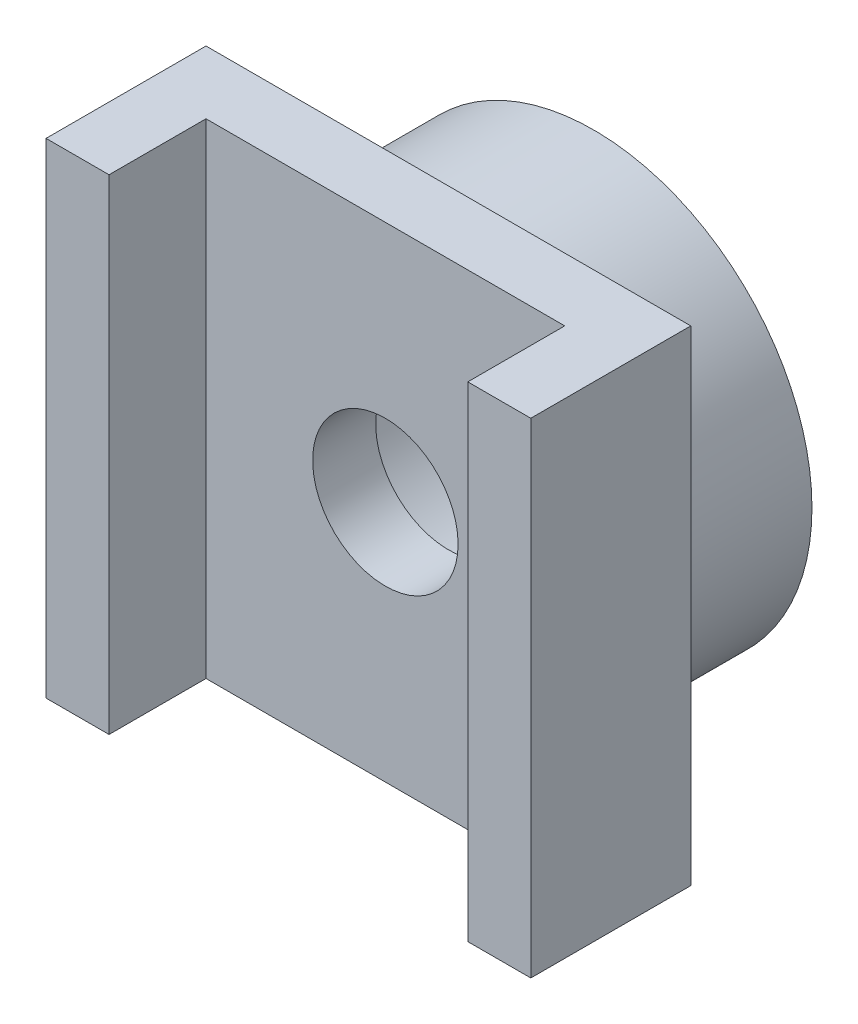
ISO-10303-21;
HEADER;
FILE_DESCRIPTION(('STEP AP214'),'2;1');
FILE_NAME('part.step','',(''),(''),'','','');
FILE_SCHEMA(('AUTOMOTIVE_DESIGN { 1 0 10303 214 1 1 1 1 }'));
ENDSEC;
DATA;
#1=APPLICATION_CONTEXT('core data for automotive mechanical design processes');
#2=APPLICATION_PROTOCOL_DEFINITION('international standard','automotive_design',2000,#1);
#3=PRODUCT_CONTEXT('',#1,'mechanical');
#4=PRODUCT('Part','Part','',(#3));
#5=PRODUCT_RELATED_PRODUCT_CATEGORY('part','',(#4));
#6=PRODUCT_DEFINITION_FORMATION('','',#4);
#7=PRODUCT_DEFINITION_CONTEXT('part definition',#1,'design');
#8=PRODUCT_DEFINITION('design','',#6,#7);
#9=PRODUCT_DEFINITION_SHAPE('','',#8);
#10=(LENGTH_UNIT() NAMED_UNIT(*) SI_UNIT(.MILLI.,.METRE.));
#11=(NAMED_UNIT(*) PLANE_ANGLE_UNIT() SI_UNIT($,.RADIAN.));
#12=(NAMED_UNIT(*) SI_UNIT($,.STERADIAN.) SOLID_ANGLE_UNIT());
#13=UNCERTAINTY_MEASURE_WITH_UNIT(LENGTH_MEASURE(1.E-05),#10,'distance_accuracy_value','');
#14=(GEOMETRIC_REPRESENTATION_CONTEXT(3) GLOBAL_UNCERTAINTY_ASSIGNED_CONTEXT((#13)) GLOBAL_UNIT_ASSIGNED_CONTEXT((#10,
#11,#12)) REPRESENTATION_CONTEXT('',''));
#15=CARTESIAN_POINT('',(0.,0.,0.));
#16=DIRECTION('',(0.,0.,1.));
#17=DIRECTION('',(1.,0.,0.));
#18=AXIS2_PLACEMENT_3D('',#15,#16,#17);
#19=CARTESIAN_POINT('',(0.,0.,4.3));
#20=DIRECTION('',(0.,0.,-1.));
#21=DIRECTION('',(-1.,0.,0.));
#22=AXIS2_PLACEMENT_3D('',#19,#20,#21);
#23=PLANE('',#22);
#24=CARTESIAN_POINT('',(0.,0.,4.3));
#25=DIRECTION('',(0.,0.,1.));
#26=DIRECTION('',(1.,0.,0.));
#27=AXIS2_PLACEMENT_3D('',#24,#25,#26);
#28=CIRCLE('',#27,1.5);
#29=CARTESIAN_POINT('',(1.5,0.,4.3));
#30=VERTEX_POINT('',#29);
#31=EDGE_CURVE('E147',#30,#30,#28,.T.);
#32=ORIENTED_EDGE('',*,*,#31,.F.);
#33=EDGE_LOOP('',(#32));
#34=FACE_BOUND('',#33,.T.);
#35=DIRECTION('',(0.,-1.,0.));
#36=VECTOR('',#35,1.);
#37=CARTESIAN_POINT('',(3.7,5.,4.3));
#38=LINE('',#37,#36);
#39=CARTESIAN_POINT('',(3.7,5.,4.3));
#40=VERTEX_POINT('',#39);
#41=CARTESIAN_POINT('',(3.7,-5.,4.3));
#42=VERTEX_POINT('',#41);
#43=EDGE_CURVE('E50',#40,#42,#38,.T.);
#44=ORIENTED_EDGE('',*,*,#43,.F.);
#45=DIRECTION('',(-1.,0.,0.));
#46=VECTOR('',#45,1.);
#47=CARTESIAN_POINT('',(-5.,5.,4.3));
#48=LINE('',#47,#46);
#49=CARTESIAN_POINT('',(-3.7,5.,4.3));
#50=VERTEX_POINT('',#49);
#51=EDGE_CURVE('E36',#40,#50,#48,.T.);
#52=ORIENTED_EDGE('',*,*,#51,.T.);
#53=DIRECTION('',(0.,1.,0.));
#54=VECTOR('',#53,1.);
#55=CARTESIAN_POINT('',(-3.7,5.,4.3));
#56=LINE('',#55,#54);
#57=CARTESIAN_POINT('',(-3.7,-5.,4.3));
#58=VERTEX_POINT('',#57);
#59=EDGE_CURVE('E133',#58,#50,#56,.T.);
#60=ORIENTED_EDGE('',*,*,#59,.F.);
#61=DIRECTION('',(1.,0.,0.));
#62=VECTOR('',#61,1.);
#63=CARTESIAN_POINT('',(-5.,-5.,4.3));
#64=LINE('',#63,#62);
#65=EDGE_CURVE('E55',#58,#42,#64,.T.);
#66=ORIENTED_EDGE('',*,*,#65,.T.);
#67=EDGE_LOOP('',(#44,#52,#60,#66));
#68=FACE_BOUND('',#67,.T.);
#69=ADVANCED_FACE('F32',(#34,#68),#23,.F.);
#70=CARTESIAN_POINT('',(0.,0.,0.));
#71=DIRECTION('',(0.,0.,1.));
#72=DIRECTION('',(1.,0.,0.));
#73=AXIS2_PLACEMENT_3D('',#70,#71,#72);
#74=PLANE('',#73);
#75=CARTESIAN_POINT('',(0.,0.,0.));
#76=DIRECTION('',(0.,0.,1.));
#77=DIRECTION('',(1.,0.,0.));
#78=AXIS2_PLACEMENT_3D('',#75,#76,#77);
#79=CIRCLE('',#78,4.5);
#80=CARTESIAN_POINT('',(4.5,0.,0.));
#81=VERTEX_POINT('',#80);
#82=EDGE_CURVE('E42',#81,#81,#79,.T.);
#83=ORIENTED_EDGE('',*,*,#82,.F.);
#84=EDGE_LOOP('',(#83));
#85=FACE_BOUND('',#84,.T.);
#86=CARTESIAN_POINT('',(0.,0.,0.));
#87=DIRECTION('',(0.,0.,1.));
#88=DIRECTION('',(1.,0.,0.));
#89=AXIS2_PLACEMENT_3D('',#86,#87,#88);
#90=CIRCLE('',#89,2.85);
#91=CARTESIAN_POINT('',(2.85,0.,0.));
#92=VERTEX_POINT('',#91);
#93=EDGE_CURVE('E189',#92,#92,#90,.T.);
#94=ORIENTED_EDGE('',*,*,#93,.T.);
#95=EDGE_LOOP('',(#94));
#96=FACE_BOUND('',#95,.T.);
#97=ADVANCED_FACE('F195',(#85,#96),#74,.F.);
#98=CARTESIAN_POINT('',(0.,0.,3.));
#99=DIRECTION('',(0.,0.,-1.));
#100=DIRECTION('',(-1.,0.,0.));
#101=AXIS2_PLACEMENT_3D('',#98,#99,#100);
#102=CYLINDRICAL_SURFACE('',#101,4.5);
#103=CARTESIAN_POINT('',(0.,0.,3.));
#104=DIRECTION('',(0.,0.,1.));
#105=DIRECTION('',(1.,0.,0.));
#106=AXIS2_PLACEMENT_3D('',#103,#104,#105);
#107=CIRCLE('',#106,4.5);
#108=CARTESIAN_POINT('',(4.5,0.,3.));
#109=VERTEX_POINT('',#108);
#110=EDGE_CURVE('E11',#109,#109,#107,.T.);
#111=ORIENTED_EDGE('',*,*,#110,.F.);
#112=EDGE_LOOP('',(#111));
#113=FACE_BOUND('',#112,.T.);
#114=ORIENTED_EDGE('',*,*,#82,.T.);
#115=EDGE_LOOP('',(#114));
#116=FACE_BOUND('',#115,.T.);
#117=ADVANCED_FACE('F34',(#113,#116),#102,.T.);
#118=CARTESIAN_POINT('',(0.,0.,3.));
#119=DIRECTION('',(0.,0.,-1.));
#120=DIRECTION('',(-1.,0.,0.));
#121=AXIS2_PLACEMENT_3D('',#118,#119,#120);
#122=CYLINDRICAL_SURFACE('',#121,2.85);
#123=CARTESIAN_POINT('',(0.,0.,3.));
#124=DIRECTION('',(0.,0.,-1.));
#125=DIRECTION('',(-1.,0.,0.));
#126=AXIS2_PLACEMENT_3D('',#123,#124,#125);
#127=CIRCLE('',#126,2.85);
#128=CARTESIAN_POINT('',(-2.85,0.,3.));
#129=VERTEX_POINT('',#128);
#130=EDGE_CURVE('E108',#129,#129,#127,.T.);
#131=ORIENTED_EDGE('',*,*,#130,.F.);
#132=EDGE_LOOP('',(#131));
#133=FACE_BOUND('',#132,.T.);
#134=ORIENTED_EDGE('',*,*,#93,.F.);
#135=EDGE_LOOP('',(#134));
#136=FACE_BOUND('',#135,.T.);
#137=ADVANCED_FACE('F200',(#133,#136),#122,.F.);
#138=CARTESIAN_POINT('',(0.,0.,3.));
#139=DIRECTION('',(0.,0.,-1.));
#140=DIRECTION('',(-1.,0.,0.));
#141=AXIS2_PLACEMENT_3D('',#138,#139,#140);
#142=PLANE('',#141);
#143=DIRECTION('',(0.,1.,0.));
#144=VECTOR('',#143,1.);
#145=CARTESIAN_POINT('',(5.,-5.,3.));
#146=LINE('',#145,#144);
#147=CARTESIAN_POINT('',(5.,-5.,3.));
#148=VERTEX_POINT('',#147);
#149=CARTESIAN_POINT('',(5.,5.,3.));
#150=VERTEX_POINT('',#149);
#151=EDGE_CURVE('E106',#148,#150,#146,.T.);
#152=ORIENTED_EDGE('',*,*,#151,.F.);
#153=DIRECTION('',(1.,0.,0.));
#154=VECTOR('',#153,1.);
#155=CARTESIAN_POINT('',(-5.,-5.,3.));
#156=LINE('',#155,#154);
#157=CARTESIAN_POINT('',(-5.,-5.,3.));
#158=VERTEX_POINT('',#157);
#159=EDGE_CURVE('E178',#158,#148,#156,.T.);
#160=ORIENTED_EDGE('',*,*,#159,.F.);
#161=DIRECTION('',(0.,-1.,0.));
#162=VECTOR('',#161,1.);
#163=CARTESIAN_POINT('',(-5.,-5.,3.));
#164=LINE('',#163,#162);
#165=CARTESIAN_POINT('',(-5.,5.,3.));
#166=VERTEX_POINT('',#165);
#167=EDGE_CURVE('E176',#166,#158,#164,.T.);
#168=ORIENTED_EDGE('',*,*,#167,.F.);
#169=DIRECTION('',(-1.,0.,0.));
#170=VECTOR('',#169,1.);
#171=CARTESIAN_POINT('',(-5.,5.,3.));
#172=LINE('',#171,#170);
#173=EDGE_CURVE('E174',#150,#166,#172,.T.);
#174=ORIENTED_EDGE('',*,*,#173,.F.);
#175=EDGE_LOOP('',(#152,#160,#168,#174));
#176=FACE_BOUND('',#175,.T.);
#177=ORIENTED_EDGE('',*,*,#110,.T.);
#178=EDGE_LOOP('',(#177));
#179=FACE_BOUND('',#178,.T.);
#180=ADVANCED_FACE('F202',(#176,#179),#142,.T.);
#181=ORIENTED_EDGE('',*,*,#130,.T.);
#182=EDGE_LOOP('',(#181));
#183=FACE_BOUND('',#182,.T.);
#184=CARTESIAN_POINT('',(0.,0.,3.));
#185=DIRECTION('',(0.,0.,1.));
#186=DIRECTION('',(1.,0.,0.));
#187=AXIS2_PLACEMENT_3D('',#184,#185,#186);
#188=CIRCLE('',#187,1.5);
#189=CARTESIAN_POINT('',(1.5,0.,3.));
#190=VERTEX_POINT('',#189);
#191=EDGE_CURVE('E161',#190,#190,#188,.T.);
#192=ORIENTED_EDGE('',*,*,#191,.T.);
#193=EDGE_LOOP('',(#192));
#194=FACE_BOUND('',#193,.T.);
#195=ADVANCED_FACE('F209',(#183,#194),#142,.T.);
#196=CARTESIAN_POINT('',(5.,-5.,4.3));
#197=DIRECTION('',(-1.,0.,0.));
#198=DIRECTION('',(0.,0.,1.));
#199=AXIS2_PLACEMENT_3D('',#196,#197,#198);
#200=PLANE('',#199);
#201=ORIENTED_EDGE('',*,*,#151,.T.);
#202=DIRECTION('',(0.,0.,-1.));
#203=VECTOR('',#202,1.);
#204=CARTESIAN_POINT('',(5.,5.,4.3));
#205=LINE('',#204,#203);
#206=CARTESIAN_POINT('',(5.,5.,6.3));
#207=VERTEX_POINT('',#206);
#208=EDGE_CURVE('E99',#207,#150,#205,.T.);
#209=ORIENTED_EDGE('',*,*,#208,.F.);
#210=DIRECTION('',(0.,1.,0.));
#211=VECTOR('',#210,1.);
#212=CARTESIAN_POINT('',(5.,5.,6.3));
#213=LINE('',#212,#211);
#214=CARTESIAN_POINT('',(5.,-5.,6.3));
#215=VERTEX_POINT('',#214);
#216=EDGE_CURVE('E104',#215,#207,#213,.T.);
#217=ORIENTED_EDGE('',*,*,#216,.F.);
#218=DIRECTION('',(0.,0.,-1.));
#219=VECTOR('',#218,1.);
#220=CARTESIAN_POINT('',(5.,-5.,4.3));
#221=LINE('',#220,#219);
#222=EDGE_CURVE('E180',#215,#148,#221,.T.);
#223=ORIENTED_EDGE('',*,*,#222,.T.);
#224=EDGE_LOOP('',(#201,#209,#217,#223));
#225=FACE_BOUND('',#224,.T.);
#226=ADVANCED_FACE('F101',(#225),#200,.F.);
#227=CARTESIAN_POINT('',(-5.,5.,4.3));
#228=DIRECTION('',(0.,-1.,0.));
#229=DIRECTION('',(0.,0.,-1.));
#230=AXIS2_PLACEMENT_3D('',#227,#228,#229);
#231=PLANE('',#230);
#232=ORIENTED_EDGE('',*,*,#173,.T.);
#233=DIRECTION('',(0.,0.,-1.));
#234=VECTOR('',#233,1.);
#235=CARTESIAN_POINT('',(-5.,5.,4.3));
#236=LINE('',#235,#234);
#237=CARTESIAN_POINT('',(-5.,5.,6.3));
#238=VERTEX_POINT('',#237);
#239=EDGE_CURVE('E109',#238,#166,#236,.T.);
#240=ORIENTED_EDGE('',*,*,#239,.F.);
#241=DIRECTION('',(-1.,0.,0.));
#242=VECTOR('',#241,1.);
#243=CARTESIAN_POINT('',(-5.,5.,6.3));
#244=LINE('',#243,#242);
#245=CARTESIAN_POINT('',(-3.7,5.,6.3));
#246=VERTEX_POINT('',#245);
#247=EDGE_CURVE('E141',#246,#238,#244,.T.);
#248=ORIENTED_EDGE('',*,*,#247,.F.);
#249=DIRECTION('',(0.,0.,-1.));
#250=VECTOR('',#249,1.);
#251=CARTESIAN_POINT('',(-3.7,5.,6.3));
#252=LINE('',#251,#250);
#253=EDGE_CURVE('E144',#246,#50,#252,.T.);
#254=ORIENTED_EDGE('',*,*,#253,.T.);
#255=ORIENTED_EDGE('',*,*,#51,.F.);
#256=DIRECTION('',(0.,0.,-1.));
#257=VECTOR('',#256,1.);
#258=CARTESIAN_POINT('',(3.7,5.,6.3));
#259=LINE('',#258,#257);
#260=CARTESIAN_POINT('',(3.7,5.,6.3));
#261=VERTEX_POINT('',#260);
#262=EDGE_CURVE('E115',#261,#40,#259,.T.);
#263=ORIENTED_EDGE('',*,*,#262,.F.);
#264=DIRECTION('',(-1.,0.,0.));
#265=VECTOR('',#264,1.);
#266=CARTESIAN_POINT('',(5.,5.,6.3));
#267=LINE('',#266,#265);
#268=EDGE_CURVE('E112',#207,#261,#267,.T.);
#269=ORIENTED_EDGE('',*,*,#268,.F.);
#270=ORIENTED_EDGE('',*,*,#208,.T.);
#271=EDGE_LOOP('',(#232,#240,#248,#254,#255,#263,#269,#270));
#272=FACE_BOUND('',#271,.T.);
#273=ADVANCED_FACE('F113',(#272),#231,.F.);
#274=CARTESIAN_POINT('',(-5.,-5.,4.3));
#275=DIRECTION('',(1.,0.,0.));
#276=DIRECTION('',(0.,0.,-1.));
#277=AXIS2_PLACEMENT_3D('',#274,#275,#276);
#278=PLANE('',#277);
#279=ORIENTED_EDGE('',*,*,#167,.T.);
#280=DIRECTION('',(0.,0.,-1.));
#281=VECTOR('',#280,1.);
#282=CARTESIAN_POINT('',(-5.,-5.,4.3));
#283=LINE('',#282,#281);
#284=CARTESIAN_POINT('',(-5.,-5.,6.3));
#285=VERTEX_POINT('',#284);
#286=EDGE_CURVE('E182',#285,#158,#283,.T.);
#287=ORIENTED_EDGE('',*,*,#286,.F.);
#288=DIRECTION('',(0.,-1.,0.));
#289=VECTOR('',#288,1.);
#290=CARTESIAN_POINT('',(-5.,5.,6.3));
#291=LINE('',#290,#289);
#292=EDGE_CURVE('E134',#238,#285,#291,.T.);
#293=ORIENTED_EDGE('',*,*,#292,.F.);
#294=ORIENTED_EDGE('',*,*,#239,.T.);
#295=EDGE_LOOP('',(#279,#287,#293,#294));
#296=FACE_BOUND('',#295,.T.);
#297=ADVANCED_FACE('F230',(#296),#278,.F.);
#298=CARTESIAN_POINT('',(-5.,-5.,4.3));
#299=DIRECTION('',(0.,1.,0.));
#300=DIRECTION('',(0.,0.,1.));
#301=AXIS2_PLACEMENT_3D('',#298,#299,#300);
#302=PLANE('',#301);
#303=ORIENTED_EDGE('',*,*,#159,.T.);
#304=ORIENTED_EDGE('',*,*,#222,.F.);
#305=DIRECTION('',(1.,0.,0.));
#306=VECTOR('',#305,1.);
#307=CARTESIAN_POINT('',(5.,-5.,6.3));
#308=LINE('',#307,#306);
#309=CARTESIAN_POINT('',(3.7,-5.,6.3));
#310=VERTEX_POINT('',#309);
#311=EDGE_CURVE('E123',#310,#215,#308,.T.);
#312=ORIENTED_EDGE('',*,*,#311,.F.);
#313=DIRECTION('',(0.,0.,-1.));
#314=VECTOR('',#313,1.);
#315=CARTESIAN_POINT('',(3.7,-5.,6.3));
#316=LINE('',#315,#314);
#317=EDGE_CURVE('E128',#310,#42,#316,.T.);
#318=ORIENTED_EDGE('',*,*,#317,.T.);
#319=ORIENTED_EDGE('',*,*,#65,.F.);
#320=DIRECTION('',(0.,0.,-1.));
#321=VECTOR('',#320,1.);
#322=CARTESIAN_POINT('',(-3.7,-5.,6.3));
#323=LINE('',#322,#321);
#324=CARTESIAN_POINT('',(-3.7,-5.,6.3));
#325=VERTEX_POINT('',#324);
#326=EDGE_CURVE('E157',#325,#58,#323,.T.);
#327=ORIENTED_EDGE('',*,*,#326,.F.);
#328=DIRECTION('',(1.,0.,0.));
#329=VECTOR('',#328,1.);
#330=CARTESIAN_POINT('',(-5.,-5.,6.3));
#331=LINE('',#330,#329);
#332=EDGE_CURVE('E137',#285,#325,#331,.T.);
#333=ORIENTED_EDGE('',*,*,#332,.F.);
#334=ORIENTED_EDGE('',*,*,#286,.T.);
#335=EDGE_LOOP('',(#303,#304,#312,#318,#319,#327,#333,#334));
#336=FACE_BOUND('',#335,.T.);
#337=ADVANCED_FACE('F227',(#336),#302,.F.);
#338=CARTESIAN_POINT('',(0.,0.,4.3));
#339=DIRECTION('',(0.,0.,-1.));
#340=DIRECTION('',(-1.,0.,0.));
#341=AXIS2_PLACEMENT_3D('',#338,#339,#340);
#342=CYLINDRICAL_SURFACE('',#341,1.5);
#343=ORIENTED_EDGE('',*,*,#31,.T.);
#344=EDGE_LOOP('',(#343));
#345=FACE_BOUND('',#344,.T.);
#346=ORIENTED_EDGE('',*,*,#191,.F.);
#347=EDGE_LOOP('',(#346));
#348=FACE_BOUND('',#347,.T.);
#349=ADVANCED_FACE('F222',(#345,#348),#342,.F.);
#350=CARTESIAN_POINT('',(-3.7,5.,6.3));
#351=DIRECTION('',(-1.,0.,0.));
#352=DIRECTION('',(0.,-1.,0.));
#353=AXIS2_PLACEMENT_3D('',#350,#351,#352);
#354=PLANE('',#353);
#355=ORIENTED_EDGE('',*,*,#59,.T.);
#356=ORIENTED_EDGE('',*,*,#253,.F.);
#357=DIRECTION('',(0.,1.,0.));
#358=VECTOR('',#357,1.);
#359=CARTESIAN_POINT('',(-3.7,5.,6.3));
#360=LINE('',#359,#358);
#361=EDGE_CURVE('E139',#325,#246,#360,.T.);
#362=ORIENTED_EDGE('',*,*,#361,.F.);
#363=ORIENTED_EDGE('',*,*,#326,.T.);
#364=EDGE_LOOP('',(#355,#356,#362,#363));
#365=FACE_BOUND('',#364,.T.);
#366=ADVANCED_FACE('F260',(#365),#354,.F.);
#367=CARTESIAN_POINT('',(0.,0.,6.3));
#368=DIRECTION('',(0.,0.,1.));
#369=DIRECTION('',(1.,0.,0.));
#370=AXIS2_PLACEMENT_3D('',#367,#368,#369);
#371=PLANE('',#370);
#372=ORIENTED_EDGE('',*,*,#292,.T.);
#373=ORIENTED_EDGE('',*,*,#332,.T.);
#374=ORIENTED_EDGE('',*,*,#361,.T.);
#375=ORIENTED_EDGE('',*,*,#247,.T.);
#376=EDGE_LOOP('',(#372,#373,#374,#375));
#377=FACE_BOUND('',#376,.T.);
#378=ADVANCED_FACE('F266',(#377),#371,.T.);
#379=CARTESIAN_POINT('',(3.7,5.,6.3));
#380=DIRECTION('',(1.,0.,0.));
#381=DIRECTION('',(0.,1.,0.));
#382=AXIS2_PLACEMENT_3D('',#379,#380,#381);
#383=PLANE('',#382);
#384=ORIENTED_EDGE('',*,*,#43,.T.);
#385=ORIENTED_EDGE('',*,*,#317,.F.);
#386=DIRECTION('',(0.,-1.,0.));
#387=VECTOR('',#386,1.);
#388=CARTESIAN_POINT('',(3.7,5.,6.3));
#389=LINE('',#388,#387);
#390=EDGE_CURVE('E118',#261,#310,#389,.T.);
#391=ORIENTED_EDGE('',*,*,#390,.F.);
#392=ORIENTED_EDGE('',*,*,#262,.T.);
#393=EDGE_LOOP('',(#384,#385,#391,#392));
#394=FACE_BOUND('',#393,.T.);
#395=ADVANCED_FACE('F272',(#394),#383,.F.);
#396=CARTESIAN_POINT('',(0.,0.,6.3));
#397=DIRECTION('',(0.,0.,-1.));
#398=DIRECTION('',(-1.,0.,0.));
#399=AXIS2_PLACEMENT_3D('',#396,#397,#398);
#400=PLANE('',#399);
#401=ORIENTED_EDGE('',*,*,#216,.T.);
#402=ORIENTED_EDGE('',*,*,#268,.T.);
#403=ORIENTED_EDGE('',*,*,#390,.T.);
#404=ORIENTED_EDGE('',*,*,#311,.T.);
#405=EDGE_LOOP('',(#401,#402,#403,#404));
#406=FACE_BOUND('',#405,.T.);
#407=ADVANCED_FACE('F121',(#406),#400,.F.);
#408=CLOSED_SHELL('',(#69,#97,#117,#137,#180,#195,#226,#273,#297,#337,#349,#366,#378,#395,#407));
#409=MANIFOLD_SOLID_BREP('B2',#408);
#410=ADVANCED_BREP_SHAPE_REPRESENTATION('',(#18,#409),#14);
#411=SHAPE_DEFINITION_REPRESENTATION(#9,#410);
ENDSEC;
END-ISO-10303-21;
